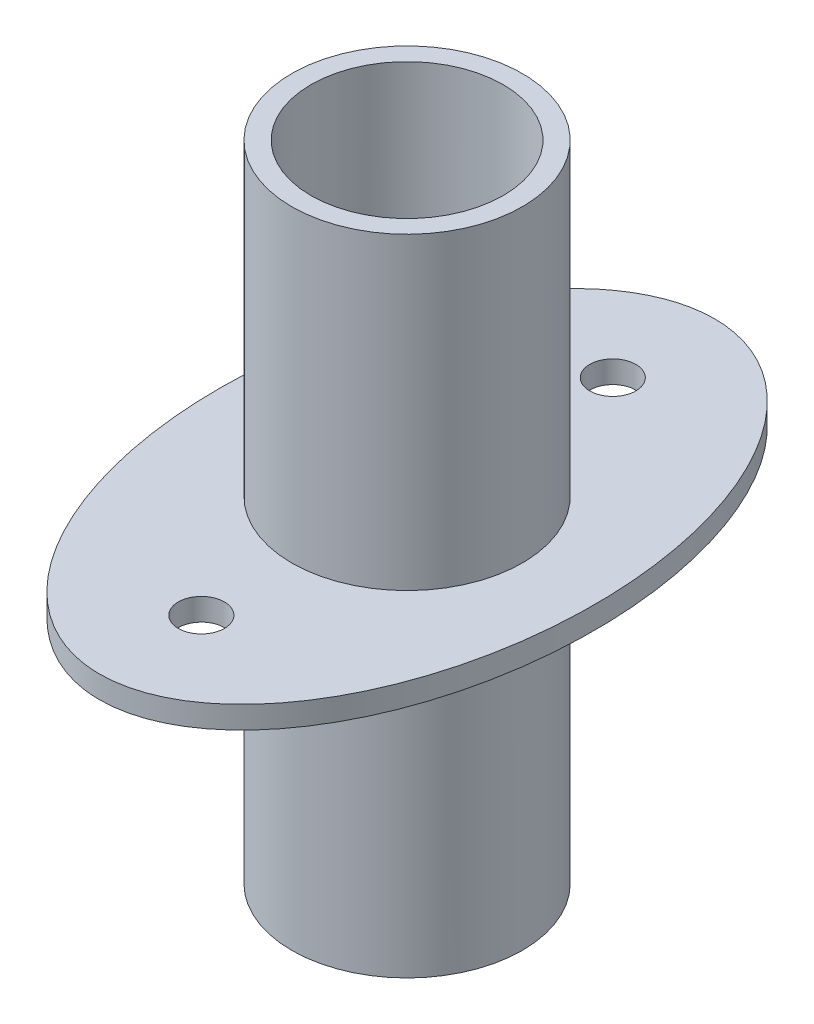
ISO-10303-21;
HEADER;
FILE_DESCRIPTION(('STEP AP214'),'2;1');
FILE_NAME('part.step','',(''),(''),'','','');
FILE_SCHEMA(('AUTOMOTIVE_DESIGN { 1 0 10303 214 1 1 1 1 }'));
ENDSEC;
DATA;
#1=APPLICATION_CONTEXT('core data for automotive mechanical design processes');
#2=APPLICATION_PROTOCOL_DEFINITION('international standard','automotive_design',2000,#1);
#3=PRODUCT_CONTEXT('',#1,'mechanical');
#4=PRODUCT('Part','Part','',(#3));
#5=PRODUCT_RELATED_PRODUCT_CATEGORY('part','',(#4));
#6=PRODUCT_DEFINITION_FORMATION('','',#4);
#7=PRODUCT_DEFINITION_CONTEXT('part definition',#1,'design');
#8=PRODUCT_DEFINITION('design','',#6,#7);
#9=PRODUCT_DEFINITION_SHAPE('','',#8);
#10=(LENGTH_UNIT() NAMED_UNIT(*) SI_UNIT(.MILLI.,.METRE.));
#11=(NAMED_UNIT(*) PLANE_ANGLE_UNIT() SI_UNIT($,.RADIAN.));
#12=(NAMED_UNIT(*) SI_UNIT($,.STERADIAN.) SOLID_ANGLE_UNIT());
#13=UNCERTAINTY_MEASURE_WITH_UNIT(LENGTH_MEASURE(1.E-05),#10,'distance_accuracy_value','');
#14=(GEOMETRIC_REPRESENTATION_CONTEXT(3) GLOBAL_UNCERTAINTY_ASSIGNED_CONTEXT((#13)) GLOBAL_UNIT_ASSIGNED_CONTEXT((#10,
#11,#12)) REPRESENTATION_CONTEXT('',''));
#15=CARTESIAN_POINT('',(0.,0.,0.));
#16=DIRECTION('',(0.,0.,1.));
#17=DIRECTION('',(1.,0.,0.));
#18=AXIS2_PLACEMENT_3D('',#15,#16,#17);
#19=CARTESIAN_POINT('',(0.,0.,0.));
#20=DIRECTION('',(0.,1.,0.));
#21=DIRECTION('',(0.,0.,1.));
#22=AXIS2_PLACEMENT_3D('',#19,#20,#21);
#23=PLANE('',#22);
#24=CARTESIAN_POINT('',(0.,0.,10.7));
#25=DIRECTION('',(0.,1.,0.));
#26=DIRECTION('',(0.,0.,1.));
#27=AXIS2_PLACEMENT_3D('',#24,#25,#26);
#28=CIRCLE('',#27,1.19798712871663);
#29=CARTESIAN_POINT('',(0.,0.,11.8979871287166));
#30=VERTEX_POINT('',#29);
#31=EDGE_CURVE('E54',#30,#30,#28,.T.);
#32=ORIENTED_EDGE('',*,*,#31,.T.);
#33=EDGE_LOOP('',(#32));
#34=FACE_BOUND('',#33,.T.);
#35=CARTESIAN_POINT('',(0.,0.,0.));
#36=DIRECTION('',(0.,1.,0.));
#37=DIRECTION('',(0.,0.,1.));
#38=AXIS2_PLACEMENT_3D('',#35,#36,#37);
#39=ELLIPSE('',#38,16.,9.75);
#40=CARTESIAN_POINT('',(0.,0.,16.));
#41=VERTEX_POINT('',#40);
#42=EDGE_CURVE('E41',#41,#41,#39,.T.);
#43=ORIENTED_EDGE('',*,*,#42,.F.);
#44=EDGE_LOOP('',(#43));
#45=FACE_BOUND('',#44,.T.);
#46=CARTESIAN_POINT('',(0.,0.,-10.7));
#47=DIRECTION('',(0.,1.,0.));
#48=DIRECTION('',(0.,0.,1.));
#49=AXIS2_PLACEMENT_3D('',#46,#47,#48);
#50=CIRCLE('',#49,1.19798712871663);
#51=CARTESIAN_POINT('',(0.,0.,-9.50201287128337));
#52=VERTEX_POINT('',#51);
#53=EDGE_CURVE('E48',#52,#52,#50,.T.);
#54=ORIENTED_EDGE('',*,*,#53,.T.);
#55=EDGE_LOOP('',(#54));
#56=FACE_BOUND('',#55,.T.);
#57=CARTESIAN_POINT('',(0.,0.,0.));
#58=DIRECTION('',(0.,1.,0.));
#59=DIRECTION('',(0.,0.,1.));
#60=AXIS2_PLACEMENT_3D('',#57,#58,#59);
#61=CIRCLE('',#60,6.);
#62=CARTESIAN_POINT('',(0.,0.,6.));
#63=VERTEX_POINT('',#62);
#64=EDGE_CURVE('E10',#63,#63,#61,.F.);
#65=ORIENTED_EDGE('',*,*,#64,.F.);
#66=EDGE_LOOP('',(#65));
#67=FACE_BOUND('',#66,.T.);
#68=ADVANCED_FACE('F29',(#34,#45,#56,#67),#23,.F.);
#69=CARTESIAN_POINT('',(0.,1.16,0.));
#70=DIRECTION('',(0.,1.,0.));
#71=DIRECTION('',(0.,0.,1.));
#72=AXIS2_PLACEMENT_3D('',#69,#70,#71);
#73=PLANE('',#72);
#74=CARTESIAN_POINT('',(0.,1.16,10.7));
#75=DIRECTION('',(0.,1.,0.));
#76=DIRECTION('',(0.,0.,1.));
#77=AXIS2_PLACEMENT_3D('',#74,#75,#76);
#78=CIRCLE('',#77,1.19798712871663);
#79=CARTESIAN_POINT('',(0.,1.16,11.8979871287166));
#80=VERTEX_POINT('',#79);
#81=EDGE_CURVE('E51',#80,#80,#78,.T.);
#82=ORIENTED_EDGE('',*,*,#81,.F.);
#83=EDGE_LOOP('',(#82));
#84=FACE_BOUND('',#83,.T.);
#85=CARTESIAN_POINT('',(0.,1.16,0.));
#86=DIRECTION('',(0.,1.,0.));
#87=DIRECTION('',(0.,0.,1.));
#88=AXIS2_PLACEMENT_3D('',#85,#86,#87);
#89=ELLIPSE('',#88,16.,9.75);
#90=CARTESIAN_POINT('',(0.,1.16,16.));
#91=VERTEX_POINT('',#90);
#92=EDGE_CURVE('E37',#91,#91,#89,.T.);
#93=ORIENTED_EDGE('',*,*,#92,.T.);
#94=EDGE_LOOP('',(#93));
#95=FACE_BOUND('',#94,.T.);
#96=CARTESIAN_POINT('',(0.,1.16,-10.7));
#97=DIRECTION('',(0.,1.,0.));
#98=DIRECTION('',(0.,0.,1.));
#99=AXIS2_PLACEMENT_3D('',#96,#97,#98);
#100=CIRCLE('',#99,1.19798712871663);
#101=CARTESIAN_POINT('',(0.,1.16,-9.50201287128337));
#102=VERTEX_POINT('',#101);
#103=EDGE_CURVE('E45',#102,#102,#100,.T.);
#104=ORIENTED_EDGE('',*,*,#103,.F.);
#105=EDGE_LOOP('',(#104));
#106=FACE_BOUND('',#105,.T.);
#107=CARTESIAN_POINT('',(0.,1.16,0.));
#108=DIRECTION('',(0.,1.,0.));
#109=DIRECTION('',(0.,0.,1.));
#110=AXIS2_PLACEMENT_3D('',#107,#108,#109);
#111=CIRCLE('',#110,6.);
#112=CARTESIAN_POINT('',(0.,1.16,6.));
#113=VERTEX_POINT('',#112);
#114=EDGE_CURVE('E60',#113,#113,#111,.T.);
#115=ORIENTED_EDGE('',*,*,#114,.F.);
#116=EDGE_LOOP('',(#115));
#117=FACE_BOUND('',#116,.T.);
#118=ADVANCED_FACE('F88',(#84,#95,#106,#117),#73,.T.);
#119=DIRECTION('',(0.,-1.,0.));
#120=VECTOR('',#119,1.);
#121=SURFACE_OF_LINEAR_EXTRUSION('',#89,#120);
#122=ORIENTED_EDGE('',*,*,#92,.F.);
#123=EDGE_LOOP('',(#122));
#124=FACE_BOUND('',#123,.T.);
#125=ORIENTED_EDGE('',*,*,#42,.T.);
#126=EDGE_LOOP('',(#125));
#127=FACE_BOUND('',#126,.T.);
#128=ADVANCED_FACE('F31',(#124,#127),#121,.F.);
#129=CARTESIAN_POINT('',(0.,1.16,-10.7));
#130=DIRECTION('',(0.,-1.,0.));
#131=DIRECTION('',(0.,0.,-1.));
#132=AXIS2_PLACEMENT_3D('',#129,#130,#131);
#133=CYLINDRICAL_SURFACE('',#132,1.19798712871663);
#134=ORIENTED_EDGE('',*,*,#103,.T.);
#135=EDGE_LOOP('',(#134));
#136=FACE_BOUND('',#135,.T.);
#137=ORIENTED_EDGE('',*,*,#53,.F.);
#138=EDGE_LOOP('',(#137));
#139=FACE_BOUND('',#138,.T.);
#140=ADVANCED_FACE('F97',(#136,#139),#133,.F.);
#141=CARTESIAN_POINT('',(0.,1.16,10.7));
#142=DIRECTION('',(0.,-1.,0.));
#143=DIRECTION('',(0.,0.,-1.));
#144=AXIS2_PLACEMENT_3D('',#141,#142,#143);
#145=CYLINDRICAL_SURFACE('',#144,1.19798712871663);
#146=ORIENTED_EDGE('',*,*,#81,.T.);
#147=EDGE_LOOP('',(#146));
#148=FACE_BOUND('',#147,.T.);
#149=ORIENTED_EDGE('',*,*,#31,.F.);
#150=EDGE_LOOP('',(#149));
#151=FACE_BOUND('',#150,.T.);
#152=ADVANCED_FACE('F100',(#148,#151),#145,.F.);
#153=CARTESIAN_POINT('',(0.,17.21,0.));
#154=DIRECTION('',(0.,-1.,0.));
#155=DIRECTION('',(0.,0.,-1.));
#156=AXIS2_PLACEMENT_3D('',#153,#154,#155);
#157=CYLINDRICAL_SURFACE('',#156,6.);
#158=CARTESIAN_POINT('',(0.,17.21,0.));
#159=DIRECTION('',(0.,1.,0.));
#160=DIRECTION('',(0.,0.,1.));
#161=AXIS2_PLACEMENT_3D('',#158,#159,#160);
#162=CIRCLE('',#161,6.);
#163=CARTESIAN_POINT('',(0.,17.21,6.));
#164=VERTEX_POINT('',#163);
#165=EDGE_CURVE('E57',#164,#164,#162,.T.);
#166=ORIENTED_EDGE('',*,*,#165,.F.);
#167=EDGE_LOOP('',(#166));
#168=FACE_BOUND('',#167,.T.);
#169=ORIENTED_EDGE('',*,*,#114,.T.);
#170=EDGE_LOOP('',(#169));
#171=FACE_BOUND('',#170,.T.);
#172=ADVANCED_FACE('F104',(#168,#171),#157,.T.);
#173=CARTESIAN_POINT('',(0.,17.21,0.));
#174=DIRECTION('',(0.,1.,0.));
#175=DIRECTION('',(0.,0.,1.));
#176=AXIS2_PLACEMENT_3D('',#173,#174,#175);
#177=PLANE('',#176);
#178=CARTESIAN_POINT('',(0.,17.21,0.));
#179=DIRECTION('',(0.,1.,0.));
#180=DIRECTION('',(0.,0.,1.));
#181=AXIS2_PLACEMENT_3D('',#178,#179,#180);
#182=CIRCLE('',#181,5.);
#183=CARTESIAN_POINT('',(0.,17.21,5.));
#184=VERTEX_POINT('',#183);
#185=EDGE_CURVE('E68',#184,#184,#182,.T.);
#186=ORIENTED_EDGE('',*,*,#185,.F.);
#187=EDGE_LOOP('',(#186));
#188=FACE_BOUND('',#187,.T.);
#189=ORIENTED_EDGE('',*,*,#165,.T.);
#190=EDGE_LOOP('',(#189));
#191=FACE_BOUND('',#190,.T.);
#192=ADVANCED_FACE('F108',(#188,#191),#177,.T.);
#193=CARTESIAN_POINT('',(0.,-16.29,0.));
#194=DIRECTION('',(0.,1.,0.));
#195=DIRECTION('',(0.,0.,1.));
#196=AXIS2_PLACEMENT_3D('',#193,#194,#195);
#197=CYLINDRICAL_SURFACE('',#196,6.);
#198=CARTESIAN_POINT('',(0.,-16.29,0.));
#199=DIRECTION('',(0.,-1.,0.));
#200=DIRECTION('',(0.,0.,-1.));
#201=AXIS2_PLACEMENT_3D('',#198,#199,#200);
#202=CIRCLE('',#201,6.);
#203=CARTESIAN_POINT('',(0.,-16.29,-6.));
#204=VERTEX_POINT('',#203);
#205=EDGE_CURVE('E63',#204,#204,#202,.T.);
#206=ORIENTED_EDGE('',*,*,#205,.F.);
#207=EDGE_LOOP('',(#206));
#208=FACE_BOUND('',#207,.T.);
#209=ORIENTED_EDGE('',*,*,#64,.T.);
#210=EDGE_LOOP('',(#209));
#211=FACE_BOUND('',#210,.T.);
#212=ADVANCED_FACE('F112',(#208,#211),#197,.T.);
#213=CARTESIAN_POINT('',(0.,-16.29,0.));
#214=DIRECTION('',(0.,-1.,0.));
#215=DIRECTION('',(0.,0.,-1.));
#216=AXIS2_PLACEMENT_3D('',#213,#214,#215);
#217=PLANE('',#216);
#218=ORIENTED_EDGE('',*,*,#205,.T.);
#219=EDGE_LOOP('',(#218));
#220=FACE_BOUND('',#219,.T.);
#221=ADVANCED_FACE('F83',(#220),#217,.T.);
#222=CARTESIAN_POINT('',(0.,17.21,0.));
#223=DIRECTION('',(0.,-1.,0.));
#224=DIRECTION('',(0.,0.,-1.));
#225=AXIS2_PLACEMENT_3D('',#222,#223,#224);
#226=CYLINDRICAL_SURFACE('',#225,5.);
#227=ORIENTED_EDGE('',*,*,#185,.T.);
#228=EDGE_LOOP('',(#227));
#229=FACE_BOUND('',#228,.T.);
#230=CARTESIAN_POINT('',(0.,-15.29,0.));
#231=DIRECTION('',(0.,-1.,0.));
#232=DIRECTION('',(0.,0.,-1.));
#233=AXIS2_PLACEMENT_3D('',#230,#231,#232);
#234=CIRCLE('',#233,5.);
#235=CARTESIAN_POINT('',(0.,-15.29,-5.));
#236=VERTEX_POINT('',#235);
#237=EDGE_CURVE('E71',#236,#236,#234,.T.);
#238=ORIENTED_EDGE('',*,*,#237,.T.);
#239=EDGE_LOOP('',(#238));
#240=FACE_BOUND('',#239,.T.);
#241=ADVANCED_FACE('F75',(#229,#240),#226,.F.);
#242=CARTESIAN_POINT('',(0.,-15.29,0.));
#243=DIRECTION('',(0.,-1.,0.));
#244=DIRECTION('',(0.,0.,-1.));
#245=AXIS2_PLACEMENT_3D('',#242,#243,#244);
#246=PLANE('',#245);
#247=ORIENTED_EDGE('',*,*,#237,.F.);
#248=EDGE_LOOP('',(#247));
#249=FACE_BOUND('',#248,.T.);
#250=ADVANCED_FACE('F77',(#249),#246,.F.);
#251=CLOSED_SHELL('',(#68,#118,#128,#140,#152,#172,#192,#212,#221,#241,#250));
#252=MANIFOLD_SOLID_BREP('B2',#251);
#253=ADVANCED_BREP_SHAPE_REPRESENTATION('',(#18,#252),#14);
#254=SHAPE_DEFINITION_REPRESENTATION(#9,#253);
ENDSEC;
END-ISO-10303-21;
